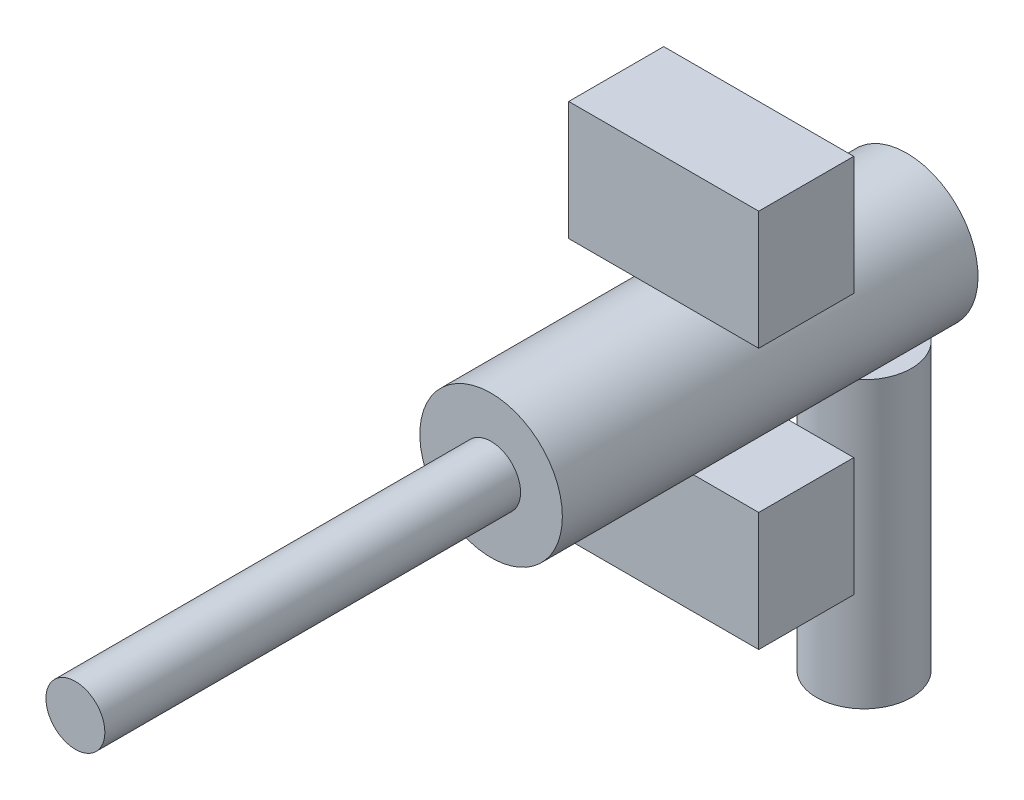
ISO-10303-21;
HEADER;
FILE_DESCRIPTION(('STEP AP214'),'2;1');
FILE_NAME('part.step','',(''),(''),'','','');
FILE_SCHEMA(('AUTOMOTIVE_DESIGN { 1 0 10303 214 1 1 1 1 }'));
ENDSEC;
DATA;
#1=APPLICATION_CONTEXT('core data for automotive mechanical design processes');
#2=APPLICATION_PROTOCOL_DEFINITION('international standard','automotive_design',2000,#1);
#3=PRODUCT_CONTEXT('',#1,'mechanical');
#4=PRODUCT('Part','Part','',(#3));
#5=PRODUCT_RELATED_PRODUCT_CATEGORY('part','',(#4));
#6=PRODUCT_DEFINITION_FORMATION('','',#4);
#7=PRODUCT_DEFINITION_CONTEXT('part definition',#1,'design');
#8=PRODUCT_DEFINITION('design','',#6,#7);
#9=PRODUCT_DEFINITION_SHAPE('','',#8);
#10=(LENGTH_UNIT() NAMED_UNIT(*) SI_UNIT(.MILLI.,.METRE.));
#11=(NAMED_UNIT(*) PLANE_ANGLE_UNIT() SI_UNIT($,.RADIAN.));
#12=(NAMED_UNIT(*) SI_UNIT($,.STERADIAN.) SOLID_ANGLE_UNIT());
#13=UNCERTAINTY_MEASURE_WITH_UNIT(LENGTH_MEASURE(1.E-05),#10,'distance_accuracy_value','');
#14=(GEOMETRIC_REPRESENTATION_CONTEXT(3) GLOBAL_UNCERTAINTY_ASSIGNED_CONTEXT((#13)) GLOBAL_UNIT_ASSIGNED_CONTEXT((#10,
#11,#12)) REPRESENTATION_CONTEXT('',''));
#15=CARTESIAN_POINT('',(0.,0.,0.));
#16=DIRECTION('',(0.,0.,1.));
#17=DIRECTION('',(1.,0.,0.));
#18=AXIS2_PLACEMENT_3D('',#15,#16,#17);
#19=CARTESIAN_POINT('',(-40.,179.48753108507,102.321831747482));
#20=DIRECTION('',(0.,0.,1.));
#21=DIRECTION('',(1.,0.,0.));
#22=AXIS2_PLACEMENT_3D('',#19,#20,#21);
#23=PLANE('',#22);
#24=DIRECTION('',(1.,0.,0.));
#25=VECTOR('',#24,1.);
#26=CARTESIAN_POINT('',(-40.,179.48753108507,102.321831747482));
#27=LINE('',#26,#25);
#28=CARTESIAN_POINT('',(-40.,179.48753108507,102.321831747482));
#29=VERTEX_POINT('',#28);
#30=CARTESIAN_POINT('',(40.,179.48753108507,102.321831747482));
#31=VERTEX_POINT('',#30);
#32=EDGE_CURVE('E55',#29,#31,#27,.T.);
#33=ORIENTED_EDGE('',*,*,#32,.T.);
#34=DIRECTION('',(0.,-1.,0.));
#35=VECTOR('',#34,1.);
#36=CARTESIAN_POINT('',(40.,179.48753108507,102.321831747482));
#37=LINE('',#36,#35);
#38=CARTESIAN_POINT('',(40.,229.48753108507,102.321831747482));
#39=VERTEX_POINT('',#38);
#40=EDGE_CURVE('E92',#39,#31,#37,.T.);
#41=ORIENTED_EDGE('',*,*,#40,.F.);
#42=DIRECTION('',(1.,0.,0.));
#43=VECTOR('',#42,1.);
#44=CARTESIAN_POINT('',(-40.,229.48753108507,102.321831747482));
#45=LINE('',#44,#43);
#46=CARTESIAN_POINT('',(-40.,229.48753108507,102.321831747482));
#47=VERTEX_POINT('',#46);
#48=EDGE_CURVE('E12',#47,#39,#45,.T.);
#49=ORIENTED_EDGE('',*,*,#48,.F.);
#50=DIRECTION('',(0.,-1.,0.));
#51=VECTOR('',#50,1.);
#52=CARTESIAN_POINT('',(-40.,179.48753108507,102.321831747482));
#53=LINE('',#52,#51);
#54=EDGE_CURVE('E93',#47,#29,#53,.T.);
#55=ORIENTED_EDGE('',*,*,#54,.T.);
#56=EDGE_LOOP('',(#33,#41,#49,#55));
#57=FACE_BOUND('',#56,.T.);
#58=ADVANCED_FACE('F52',(#57),#23,.T.);
#59=CARTESIAN_POINT('',(-40.,229.48753108507,102.321831747482));
#60=DIRECTION('',(0.,1.,0.));
#61=DIRECTION('',(0.,0.,1.));
#62=AXIS2_PLACEMENT_3D('',#59,#60,#61);
#63=PLANE('',#62);
#64=ORIENTED_EDGE('',*,*,#48,.T.);
#65=DIRECTION('',(0.,0.,1.));
#66=VECTOR('',#65,1.);
#67=CARTESIAN_POINT('',(40.,229.48753108507,102.321831747482));
#68=LINE('',#67,#66);
#69=CARTESIAN_POINT('',(40.,229.48753108507,62.3218317474823));
#70=VERTEX_POINT('',#69);
#71=EDGE_CURVE('E109',#70,#39,#68,.T.);
#72=ORIENTED_EDGE('',*,*,#71,.F.);
#73=DIRECTION('',(1.,0.,0.));
#74=VECTOR('',#73,1.);
#75=CARTESIAN_POINT('',(-40.,229.48753108507,62.3218317474823));
#76=LINE('',#75,#74);
#77=CARTESIAN_POINT('',(-40.,229.48753108507,62.3218317474823));
#78=VERTEX_POINT('',#77);
#79=EDGE_CURVE('E60',#78,#70,#76,.T.);
#80=ORIENTED_EDGE('',*,*,#79,.F.);
#81=DIRECTION('',(0.,0.,1.));
#82=VECTOR('',#81,1.);
#83=CARTESIAN_POINT('',(-40.,229.48753108507,102.321831747482));
#84=LINE('',#83,#82);
#85=EDGE_CURVE('E98',#78,#47,#84,.T.);
#86=ORIENTED_EDGE('',*,*,#85,.T.);
#87=EDGE_LOOP('',(#64,#72,#80,#86));
#88=FACE_BOUND('',#87,.T.);
#89=ADVANCED_FACE('F124',(#88),#63,.T.);
#90=CARTESIAN_POINT('',(-40.,179.48753108507,62.3218317474823));
#91=DIRECTION('',(0.,0.,-1.));
#92=DIRECTION('',(-1.,0.,0.));
#93=AXIS2_PLACEMENT_3D('',#90,#91,#92);
#94=PLANE('',#93);
#95=ORIENTED_EDGE('',*,*,#79,.T.);
#96=DIRECTION('',(0.,1.,0.));
#97=VECTOR('',#96,1.);
#98=CARTESIAN_POINT('',(40.,179.48753108507,62.3218317474823));
#99=LINE('',#98,#97);
#100=CARTESIAN_POINT('',(40.,179.48753108507,62.3218317474823));
#101=VERTEX_POINT('',#100);
#102=EDGE_CURVE('E105',#101,#70,#99,.T.);
#103=ORIENTED_EDGE('',*,*,#102,.F.);
#104=DIRECTION('',(1.,0.,0.));
#105=VECTOR('',#104,1.);
#106=CARTESIAN_POINT('',(-40.,179.48753108507,62.3218317474823));
#107=LINE('',#106,#105);
#108=CARTESIAN_POINT('',(-40.,179.48753108507,62.3218317474823));
#109=VERTEX_POINT('',#108);
#110=EDGE_CURVE('E97',#109,#101,#107,.T.);
#111=ORIENTED_EDGE('',*,*,#110,.F.);
#112=DIRECTION('',(0.,1.,0.));
#113=VECTOR('',#112,1.);
#114=CARTESIAN_POINT('',(-40.,179.48753108507,62.3218317474823));
#115=LINE('',#114,#113);
#116=EDGE_CURVE('E117',#109,#78,#115,.T.);
#117=ORIENTED_EDGE('',*,*,#116,.T.);
#118=EDGE_LOOP('',(#95,#103,#111,#117));
#119=FACE_BOUND('',#118,.T.);
#120=ADVANCED_FACE('F121',(#119),#94,.T.);
#121=CARTESIAN_POINT('',(-40.,179.48753108507,102.321831747482));
#122=DIRECTION('',(0.,-1.,0.));
#123=DIRECTION('',(0.,0.,-1.));
#124=AXIS2_PLACEMENT_3D('',#121,#122,#123);
#125=PLANE('',#124);
#126=ORIENTED_EDGE('',*,*,#110,.T.);
#127=DIRECTION('',(0.,0.,-1.));
#128=VECTOR('',#127,1.);
#129=CARTESIAN_POINT('',(40.,179.48753108507,102.321831747482));
#130=LINE('',#129,#128);
#131=EDGE_CURVE('E100',#31,#101,#130,.T.);
#132=ORIENTED_EDGE('',*,*,#131,.F.);
#133=ORIENTED_EDGE('',*,*,#32,.F.);
#134=DIRECTION('',(0.,0.,-1.));
#135=VECTOR('',#134,1.);
#136=CARTESIAN_POINT('',(-40.,179.48753108507,102.321831747482));
#137=LINE('',#136,#135);
#138=EDGE_CURVE('E115',#29,#109,#137,.T.);
#139=ORIENTED_EDGE('',*,*,#138,.T.);
#140=EDGE_LOOP('',(#126,#132,#133,#139));
#141=FACE_BOUND('',#140,.T.);
#142=ADVANCED_FACE('F101',(#141),#125,.T.);
#143=CARTESIAN_POINT('',(-40.,0.,0.));
#144=DIRECTION('',(-1.,0.,0.));
#145=DIRECTION('',(0.,0.,1.));
#146=AXIS2_PLACEMENT_3D('',#143,#144,#145);
#147=PLANE('',#146);
#148=ORIENTED_EDGE('',*,*,#54,.F.);
#149=ORIENTED_EDGE('',*,*,#85,.F.);
#150=ORIENTED_EDGE('',*,*,#116,.F.);
#151=ORIENTED_EDGE('',*,*,#138,.F.);
#152=EDGE_LOOP('',(#148,#149,#150,#151));
#153=FACE_BOUND('',#152,.T.);
#154=ADVANCED_FACE('F126',(#153),#147,.T.);
#155=CARTESIAN_POINT('',(40.,0.,0.));
#156=DIRECTION('',(-1.,0.,0.));
#157=DIRECTION('',(0.,0.,1.));
#158=AXIS2_PLACEMENT_3D('',#155,#156,#157);
#159=PLANE('',#158);
#160=ORIENTED_EDGE('',*,*,#40,.T.);
#161=ORIENTED_EDGE('',*,*,#131,.T.);
#162=ORIENTED_EDGE('',*,*,#102,.T.);
#163=ORIENTED_EDGE('',*,*,#71,.T.);
#164=EDGE_LOOP('',(#160,#161,#162,#163));
#165=FACE_BOUND('',#164,.T.);
#166=ADVANCED_FACE('F108',(#165),#159,.F.);
#167=CLOSED_SHELL('',(#58,#89,#120,#142,#154,#166));
#168=MANIFOLD_SOLID_BREP('B2',#167);
#169=CARTESIAN_POINT('',(0.,120.,17.9882332348629));
#170=DIRECTION('',(0.,-1.,0.));
#171=DIRECTION('',(0.,0.,-1.));
#172=AXIS2_PLACEMENT_3D('',#169,#170,#171);
#173=CYLINDRICAL_SURFACE('',#172,20.);
#174=CARTESIAN_POINT('',(0.,0.,17.9882332348629));
#175=DIRECTION('',(0.,1.,0.));
#176=DIRECTION('',(0.,0.,1.));
#177=AXIS2_PLACEMENT_3D('',#174,#175,#176);
#178=CIRCLE('',#177,20.);
#179=CARTESIAN_POINT('',(0.,0.,37.9882332348629));
#180=VERTEX_POINT('',#179);
#181=EDGE_CURVE('E301',#180,#180,#178,.T.);
#182=ORIENTED_EDGE('',*,*,#181,.T.);
#183=EDGE_LOOP('',(#182));
#184=FACE_BOUND('',#183,.T.);
#185=CARTESIAN_POINT('',(-5.52136853570222,120.,37.2109929090865));
#186=CARTESIAN_POINT('',(-5.29193302138808,119.957037804867,37.2768943103946));
#187=CARTESIAN_POINT('',(-5.06091253679001,119.916554845313,37.3388024333484));
#188=CARTESIAN_POINT('',(-4.59598902122757,119.840737590571,37.45446777266));
#189=CARTESIAN_POINT('',(-4.36208580677418,119.805403624977,37.5082244672428));
#190=CARTESIAN_POINT('',(-3.65650935186533,119.707415802089,37.657012798175));
#191=CARTESIAN_POINT('',(-3.18098714133821,119.652779380687,37.7395575443784));
#192=CARTESIAN_POINT('',(-2.23648701823118,119.567357095238,37.8683503241664));
#193=CARTESIAN_POINT('',(-1.76769162302292,119.535953618657,37.9155387256518));
#194=CARTESIAN_POINT('',(-0.827057573782967,119.495240836377,37.9766799810276));
#195=CARTESIAN_POINT('',(-0.355219623911195,119.485926590303,37.9906402665685));
#196=CARTESIAN_POINT('',(0.569300120255673,119.489514564927,37.9852577339645));
#197=CARTESIAN_POINT('',(1.02199373849564,119.501543628949,37.9672238052882));
#198=CARTESIAN_POINT('',(1.92417509509118,119.545894783714,37.9005962290482));
#199=CARTESIAN_POINT('',(2.37366234055385,119.578219929223,37.8519979812443));
#200=CARTESIAN_POINT('',(3.27874165463821,119.663681644793,37.7230855988506));
#201=CARTESIAN_POINT('',(3.73416545758765,119.717362201779,37.641941952275));
#202=CARTESIAN_POINT('',(4.41014591507068,119.812584102018,37.4973022562262));
#203=CARTESIAN_POINT('',(4.63428007047814,119.8467748898,37.44526835514));
#204=CARTESIAN_POINT('',(5.07988498020442,119.919884182736,37.3337108859222));
#205=CARTESIAN_POINT('',(5.3013558830419,119.958802422903,37.2741877375769));
#206=CARTESIAN_POINT('',(5.52136853570222,120.,37.2109929090865));
#207=B_SPLINE_CURVE_WITH_KNOTS('',3,(#185,#186,#187,#188,#189,#190,#191,#192,#193,#194,#195,
#196,#197,#198,#199,#200,#201,#202,#203,#204,#205,#206),.UNSPECIFIED.,.F.,.F.,(4,2,2,2,2,2,2,2,
2,2,4),(0.,0.727539342602564,1.45512523556241,2.91035344813136,4.32535051133285,
5.74003107292185,7.09816389103255,8.45650117085002,9.85191582673059,10.5496223790287,
11.2472898409633),.UNSPECIFIED.);
#208=CARTESIAN_POINT('',(-5.52136853570222,120.,37.2109929090865));
#209=VERTEX_POINT('',#208);
#210=CARTESIAN_POINT('',(5.52136853570222,120.,37.2109929090865));
#211=VERTEX_POINT('',#210);
#212=EDGE_CURVE('E293',#209,#211,#207,.T.);
#213=ORIENTED_EDGE('',*,*,#212,.F.);
#214=CARTESIAN_POINT('',(0.,120.,17.9882332348629));
#215=DIRECTION('',(0.,1.,0.));
#216=DIRECTION('',(0.,0.,1.));
#217=AXIS2_PLACEMENT_3D('',#214,#215,#216);
#218=CIRCLE('',#217,20.);
#219=EDGE_CURVE('E302',#211,#209,#218,.T.);
#220=ORIENTED_EDGE('',*,*,#219,.F.);
#221=EDGE_LOOP('',(#213,#220));
#222=FACE_BOUND('',#221,.T.);
#223=ADVANCED_FACE('F175',(#184,#222),#173,.T.);
#224=CARTESIAN_POINT('',(0.,120.,17.9882332348629));
#225=DIRECTION('',(0.,1.,0.));
#226=DIRECTION('',(0.,0.,1.));
#227=AXIS2_PLACEMENT_3D('',#224,#225,#226);
#228=PLANE('',#227);
#229=DIRECTION('',(1.,0.,0.));
#230=VECTOR('',#229,1.);
#231=CARTESIAN_POINT('',(0.,120.,0.));
#232=LINE('',#231,#230);
#233=CARTESIAN_POINT('',(-5.52136853570222,120.,0.));
#234=VERTEX_POINT('',#233);
#235=CARTESIAN_POINT('',(5.52136853570222,120.,0.));
#236=VERTEX_POINT('',#235);
#237=EDGE_CURVE('E336',#234,#236,#232,.T.);
#238=ORIENTED_EDGE('',*,*,#237,.T.);
#239=DIRECTION('',(0.,0.,-1.));
#240=VECTOR('',#239,1.);
#241=CARTESIAN_POINT('',(5.52136853570222,120.,175.));
#242=LINE('',#241,#240);
#243=EDGE_CURVE('E289',#236,#211,#242,.F.);
#244=ORIENTED_EDGE('',*,*,#243,.T.);
#245=ORIENTED_EDGE('',*,*,#219,.T.);
#246=DIRECTION('',(0.,0.,-1.));
#247=VECTOR('',#246,1.);
#248=CARTESIAN_POINT('',(-5.52136853570222,120.,175.));
#249=LINE('',#248,#247);
#250=EDGE_CURVE('E335',#209,#234,#249,.T.);
#251=ORIENTED_EDGE('',*,*,#250,.T.);
#252=EDGE_LOOP('',(#238,#244,#245,#251));
#253=FACE_BOUND('',#252,.T.);
#254=ADVANCED_FACE('F314',(#253),#228,.T.);
#255=CARTESIAN_POINT('',(0.,0.,17.9882332348629));
#256=DIRECTION('',(0.,1.,0.));
#257=DIRECTION('',(0.,0.,1.));
#258=AXIS2_PLACEMENT_3D('',#255,#256,#257);
#259=PLANE('',#258);
#260=ORIENTED_EDGE('',*,*,#181,.F.);
#261=EDGE_LOOP('',(#260));
#262=FACE_BOUND('',#261,.T.);
#263=ADVANCED_FACE('F310',(#262),#259,.F.);
#264=CARTESIAN_POINT('',(0.,149.48753108507,175.));
#265=DIRECTION('',(0.,0.,-1.));
#266=DIRECTION('',(-1.,0.,0.));
#267=AXIS2_PLACEMENT_3D('',#264,#265,#266);
#268=CYLINDRICAL_SURFACE('',#267,30.);
#269=DIRECTION('',(0.,0.,-1.));
#270=VECTOR('',#269,1.);
#271=CARTESIAN_POINT('',(-3.03737003392138,119.641687433448,175.));
#272=LINE('',#271,#270);
#273=CARTESIAN_POINT('',(-3.03737003392138,119.641687433448,62.3218317474823));
#274=VERTEX_POINT('',#273);
#275=CARTESIAN_POINT('',(-3.03737003392138,119.641687433448,102.321831747482));
#276=VERTEX_POINT('',#275);
#277=EDGE_CURVE('E343',#274,#276,#272,.F.);
#278=ORIENTED_EDGE('',*,*,#277,.T.);
#279=CARTESIAN_POINT('',(0.,149.48753108507,102.321831747482));
#280=DIRECTION('',(0.,0.,1.));
#281=DIRECTION('',(1.,0.,0.));
#282=AXIS2_PLACEMENT_3D('',#279,#280,#281);
#283=CIRCLE('',#282,30.);
#284=CARTESIAN_POINT('',(3.03737003392138,119.641687433448,102.321831747482));
#285=VERTEX_POINT('',#284);
#286=EDGE_CURVE('E50',#276,#285,#283,.T.);
#287=ORIENTED_EDGE('',*,*,#286,.T.);
#288=DIRECTION('',(0.,0.,-1.));
#289=VECTOR('',#288,1.);
#290=CARTESIAN_POINT('',(3.03737003392138,119.641687433448,175.));
#291=LINE('',#290,#289);
#292=CARTESIAN_POINT('',(3.03737003392138,119.641687433448,62.3218317474823));
#293=VERTEX_POINT('',#292);
#294=EDGE_CURVE('E183',#285,#293,#291,.T.);
#295=ORIENTED_EDGE('',*,*,#294,.T.);
#296=CARTESIAN_POINT('',(0.,149.48753108507,62.3218317474823));
#297=DIRECTION('',(0.,0.,-1.));
#298=DIRECTION('',(-1.,0.,0.));
#299=AXIS2_PLACEMENT_3D('',#296,#297,#298);
#300=CIRCLE('',#299,30.);
#301=EDGE_CURVE('E288',#293,#274,#300,.T.);
#302=ORIENTED_EDGE('',*,*,#301,.T.);
#303=EDGE_LOOP('',(#278,#287,#295,#302));
#304=FACE_BOUND('',#303,.T.);
#305=ORIENTED_EDGE('',*,*,#243,.F.);
#306=CARTESIAN_POINT('',(0.,149.48753108507,0.));
#307=DIRECTION('',(0.,0.,1.));
#308=DIRECTION('',(1.,0.,0.));
#309=AXIS2_PLACEMENT_3D('',#306,#307,#308);
#310=CIRCLE('',#309,30.);
#311=EDGE_CURVE('E197',#236,#234,#310,.T.);
#312=ORIENTED_EDGE('',*,*,#311,.T.);
#313=ORIENTED_EDGE('',*,*,#250,.F.);
#314=ORIENTED_EDGE('',*,*,#212,.T.);
#315=EDGE_LOOP('',(#305,#312,#313,#314));
#316=FACE_BOUND('',#315,.T.);
#317=CARTESIAN_POINT('',(0.,149.48753108507,175.));
#318=DIRECTION('',(0.,0.,1.));
#319=DIRECTION('',(1.,0.,0.));
#320=AXIS2_PLACEMENT_3D('',#317,#318,#319);
#321=CIRCLE('',#320,30.);
#322=CARTESIAN_POINT('',(30.,149.48753108507,175.));
#323=VERTEX_POINT('',#322);
#324=EDGE_CURVE('E290',#323,#323,#321,.T.);
#325=ORIENTED_EDGE('',*,*,#324,.F.);
#326=EDGE_LOOP('',(#325));
#327=FACE_BOUND('',#326,.T.);
#328=ADVANCED_FACE('F304',(#304,#316,#327),#268,.T.);
#329=CARTESIAN_POINT('',(0.,149.48753108507,175.));
#330=DIRECTION('',(0.,0.,1.));
#331=DIRECTION('',(1.,0.,0.));
#332=AXIS2_PLACEMENT_3D('',#329,#330,#331);
#333=PLANE('',#332);
#334=CARTESIAN_POINT('',(0.,149.48753108507,175.));
#335=DIRECTION('',(0.,0.,1.));
#336=DIRECTION('',(1.,0.,0.));
#337=AXIS2_PLACEMENT_3D('',#334,#335,#336);
#338=CIRCLE('',#337,12.4009204125942);
#339=CARTESIAN_POINT('',(12.4009204125942,149.48753108507,175.));
#340=VERTEX_POINT('',#339);
#341=EDGE_CURVE('E285',#340,#340,#338,.T.);
#342=ORIENTED_EDGE('',*,*,#341,.F.);
#343=EDGE_LOOP('',(#342));
#344=FACE_BOUND('',#343,.T.);
#345=ORIENTED_EDGE('',*,*,#324,.T.);
#346=EDGE_LOOP('',(#345));
#347=FACE_BOUND('',#346,.T.);
#348=ADVANCED_FACE('F309',(#344,#347),#333,.T.);
#349=CARTESIAN_POINT('',(0.,149.48753108507,0.));
#350=DIRECTION('',(0.,0.,1.));
#351=DIRECTION('',(1.,0.,0.));
#352=AXIS2_PLACEMENT_3D('',#349,#350,#351);
#353=PLANE('',#352);
#354=ORIENTED_EDGE('',*,*,#237,.F.);
#355=ORIENTED_EDGE('',*,*,#311,.F.);
#356=EDGE_LOOP('',(#354,#355));
#357=FACE_BOUND('',#356,.T.);
#358=ADVANCED_FACE('F312',(#357),#353,.F.);
#359=CARTESIAN_POINT('',(0.,149.48753108507,350.));
#360=DIRECTION('',(0.,0.,-1.));
#361=DIRECTION('',(-1.,0.,0.));
#362=AXIS2_PLACEMENT_3D('',#359,#360,#361);
#363=CYLINDRICAL_SURFACE('',#362,12.4009204125942);
#364=CARTESIAN_POINT('',(0.,149.48753108507,350.));
#365=DIRECTION('',(0.,0.,1.));
#366=DIRECTION('',(1.,0.,0.));
#367=AXIS2_PLACEMENT_3D('',#364,#365,#366);
#368=CIRCLE('',#367,12.4009204125942);
#369=CARTESIAN_POINT('',(12.4009204125942,149.48753108507,350.));
#370=VERTEX_POINT('',#369);
#371=EDGE_CURVE('E282',#370,#370,#368,.T.);
#372=ORIENTED_EDGE('',*,*,#371,.F.);
#373=EDGE_LOOP('',(#372));
#374=FACE_BOUND('',#373,.T.);
#375=ORIENTED_EDGE('',*,*,#341,.T.);
#376=EDGE_LOOP('',(#375));
#377=FACE_BOUND('',#376,.T.);
#378=ADVANCED_FACE('F375',(#374,#377),#363,.T.);
#379=CARTESIAN_POINT('',(0.,149.48753108507,350.));
#380=DIRECTION('',(0.,0.,1.));
#381=DIRECTION('',(1.,0.,0.));
#382=AXIS2_PLACEMENT_3D('',#379,#380,#381);
#383=PLANE('',#382);
#384=ORIENTED_EDGE('',*,*,#371,.T.);
#385=EDGE_LOOP('',(#384));
#386=FACE_BOUND('',#385,.T.);
#387=ADVANCED_FACE('F369',(#386),#383,.T.);
#388=CARTESIAN_POINT('',(-40.,119.641687433448,102.321831747482));
#389=DIRECTION('',(0.,1.,0.));
#390=DIRECTION('',(0.,0.,1.));
#391=AXIS2_PLACEMENT_3D('',#388,#389,#390);
#392=PLANE('',#391);
#393=ORIENTED_EDGE('',*,*,#294,.F.);
#394=DIRECTION('',(1.,0.,0.));
#395=VECTOR('',#394,1.);
#396=CARTESIAN_POINT('',(-40.,119.641687433448,102.321831747482));
#397=LINE('',#396,#395);
#398=CARTESIAN_POINT('',(40.,119.641687433448,102.321831747482));
#399=VERTEX_POINT('',#398);
#400=EDGE_CURVE('E249',#285,#399,#397,.T.);
#401=ORIENTED_EDGE('',*,*,#400,.T.);
#402=DIRECTION('',(0.,0.,1.));
#403=VECTOR('',#402,1.);
#404=CARTESIAN_POINT('',(40.,119.641687433448,102.321831747482));
#405=LINE('',#404,#403);
#406=CARTESIAN_POINT('',(40.,119.641687433448,62.3218317474823));
#407=VERTEX_POINT('',#406);
#408=EDGE_CURVE('E259',#407,#399,#405,.T.);
#409=ORIENTED_EDGE('',*,*,#408,.F.);
#410=DIRECTION('',(1.,0.,0.));
#411=VECTOR('',#410,1.);
#412=CARTESIAN_POINT('',(-40.,119.641687433448,62.3218317474823));
#413=LINE('',#412,#411);
#414=EDGE_CURVE('E248',#293,#407,#413,.T.);
#415=ORIENTED_EDGE('',*,*,#414,.F.);
#416=EDGE_LOOP('',(#393,#401,#409,#415));
#417=FACE_BOUND('',#416,.T.);
#418=ADVANCED_FACE('F347',(#417),#392,.T.);
#419=ORIENTED_EDGE('',*,*,#277,.F.);
#420=CARTESIAN_POINT('',(-40.,119.641687433448,62.3218317474823));
#421=VERTEX_POINT('',#420);
#422=EDGE_CURVE('E190',#421,#274,#413,.T.);
#423=ORIENTED_EDGE('',*,*,#422,.F.);
#424=DIRECTION('',(0.,0.,1.));
#425=VECTOR('',#424,1.);
#426=CARTESIAN_POINT('',(-40.,119.641687433448,102.321831747482));
#427=LINE('',#426,#425);
#428=CARTESIAN_POINT('',(-40.,119.641687433448,102.321831747482));
#429=VERTEX_POINT('',#428);
#430=EDGE_CURVE('E256',#421,#429,#427,.T.);
#431=ORIENTED_EDGE('',*,*,#430,.T.);
#432=EDGE_CURVE('E240',#429,#276,#397,.T.);
#433=ORIENTED_EDGE('',*,*,#432,.T.);
#434=EDGE_LOOP('',(#419,#423,#431,#433));
#435=FACE_BOUND('',#434,.T.);
#436=ADVANCED_FACE('F261',(#435),#392,.T.);
#437=CARTESIAN_POINT('',(-40.,119.641687433448,102.321831747482));
#438=DIRECTION('',(0.,0.,1.));
#439=DIRECTION('',(1.,0.,0.));
#440=AXIS2_PLACEMENT_3D('',#437,#438,#439);
#441=PLANE('',#440);
#442=ORIENTED_EDGE('',*,*,#286,.F.);
#443=ORIENTED_EDGE('',*,*,#432,.F.);
#444=DIRECTION('',(0.,-1.,0.));
#445=VECTOR('',#444,1.);
#446=CARTESIAN_POINT('',(-40.,119.641687433448,102.321831747482));
#447=LINE('',#446,#445);
#448=CARTESIAN_POINT('',(-40.,69.6416874334483,102.321831747482));
#449=VERTEX_POINT('',#448);
#450=EDGE_CURVE('E243',#429,#449,#447,.T.);
#451=ORIENTED_EDGE('',*,*,#450,.T.);
#452=DIRECTION('',(1.,0.,0.));
#453=VECTOR('',#452,1.);
#454=CARTESIAN_POINT('',(-40.,69.6416874334483,102.321831747482));
#455=LINE('',#454,#453);
#456=CARTESIAN_POINT('',(40.,69.6416874334483,102.321831747482));
#457=VERTEX_POINT('',#456);
#458=EDGE_CURVE('E263',#449,#457,#455,.T.);
#459=ORIENTED_EDGE('',*,*,#458,.T.);
#460=DIRECTION('',(0.,-1.,0.));
#461=VECTOR('',#460,1.);
#462=CARTESIAN_POINT('',(40.,119.641687433448,102.321831747482));
#463=LINE('',#462,#461);
#464=EDGE_CURVE('E279',#399,#457,#463,.T.);
#465=ORIENTED_EDGE('',*,*,#464,.F.);
#466=ORIENTED_EDGE('',*,*,#400,.F.);
#467=EDGE_LOOP('',(#442,#443,#451,#459,#465,#466));
#468=FACE_BOUND('',#467,.T.);
#469=ADVANCED_FACE('F242',(#468),#441,.T.);
#470=CARTESIAN_POINT('',(-40.,119.641687433448,62.3218317474823));
#471=DIRECTION('',(0.,0.,-1.));
#472=DIRECTION('',(-1.,0.,0.));
#473=AXIS2_PLACEMENT_3D('',#470,#471,#472);
#474=PLANE('',#473);
#475=ORIENTED_EDGE('',*,*,#301,.F.);
#476=ORIENTED_EDGE('',*,*,#414,.T.);
#477=DIRECTION('',(0.,1.,0.));
#478=VECTOR('',#477,1.);
#479=CARTESIAN_POINT('',(40.,119.641687433448,62.3218317474823));
#480=LINE('',#479,#478);
#481=CARTESIAN_POINT('',(40.,69.6416874334483,62.3218317474823));
#482=VERTEX_POINT('',#481);
#483=EDGE_CURVE('E273',#482,#407,#480,.T.);
#484=ORIENTED_EDGE('',*,*,#483,.F.);
#485=DIRECTION('',(1.,0.,0.));
#486=VECTOR('',#485,1.);
#487=CARTESIAN_POINT('',(-40.,69.6416874334483,62.3218317474823));
#488=LINE('',#487,#486);
#489=CARTESIAN_POINT('',(-40.,69.6416874334483,62.3218317474823));
#490=VERTEX_POINT('',#489);
#491=EDGE_CURVE('E266',#490,#482,#488,.T.);
#492=ORIENTED_EDGE('',*,*,#491,.F.);
#493=DIRECTION('',(0.,1.,0.));
#494=VECTOR('',#493,1.);
#495=CARTESIAN_POINT('',(-40.,119.641687433448,62.3218317474823));
#496=LINE('',#495,#494);
#497=EDGE_CURVE('E262',#490,#421,#496,.T.);
#498=ORIENTED_EDGE('',*,*,#497,.T.);
#499=ORIENTED_EDGE('',*,*,#422,.T.);
#500=EDGE_LOOP('',(#475,#476,#484,#492,#498,#499));
#501=FACE_BOUND('',#500,.T.);
#502=ADVANCED_FACE('F354',(#501),#474,.T.);
#503=CARTESIAN_POINT('',(-40.,69.6416874334483,102.321831747482));
#504=DIRECTION('',(0.,-1.,0.));
#505=DIRECTION('',(0.,0.,-1.));
#506=AXIS2_PLACEMENT_3D('',#503,#504,#505);
#507=PLANE('',#506);
#508=ORIENTED_EDGE('',*,*,#491,.T.);
#509=DIRECTION('',(0.,0.,-1.));
#510=VECTOR('',#509,1.);
#511=CARTESIAN_POINT('',(40.,69.6416874334483,102.321831747482));
#512=LINE('',#511,#510);
#513=EDGE_CURVE('E276',#457,#482,#512,.T.);
#514=ORIENTED_EDGE('',*,*,#513,.F.);
#515=ORIENTED_EDGE('',*,*,#458,.F.);
#516=DIRECTION('',(0.,0.,-1.));
#517=VECTOR('',#516,1.);
#518=CARTESIAN_POINT('',(-40.,69.6416874334483,102.321831747482));
#519=LINE('',#518,#517);
#520=EDGE_CURVE('E258',#449,#490,#519,.T.);
#521=ORIENTED_EDGE('',*,*,#520,.T.);
#522=EDGE_LOOP('',(#508,#514,#515,#521));
#523=FACE_BOUND('',#522,.T.);
#524=ADVANCED_FACE('F357',(#523),#507,.T.);
#525=CARTESIAN_POINT('',(-40.,0.,0.));
#526=DIRECTION('',(1.,0.,0.));
#527=DIRECTION('',(0.,0.,-1.));
#528=AXIS2_PLACEMENT_3D('',#525,#526,#527);
#529=PLANE('',#528);
#530=ORIENTED_EDGE('',*,*,#450,.F.);
#531=ORIENTED_EDGE('',*,*,#430,.F.);
#532=ORIENTED_EDGE('',*,*,#497,.F.);
#533=ORIENTED_EDGE('',*,*,#520,.F.);
#534=EDGE_LOOP('',(#530,#531,#532,#533));
#535=FACE_BOUND('',#534,.T.);
#536=ADVANCED_FACE('F254',(#535),#529,.F.);
#537=CARTESIAN_POINT('',(40.,0.,0.));
#538=DIRECTION('',(1.,0.,0.));
#539=DIRECTION('',(0.,0.,-1.));
#540=AXIS2_PLACEMENT_3D('',#537,#538,#539);
#541=PLANE('',#540);
#542=ORIENTED_EDGE('',*,*,#464,.T.);
#543=ORIENTED_EDGE('',*,*,#513,.T.);
#544=ORIENTED_EDGE('',*,*,#483,.T.);
#545=ORIENTED_EDGE('',*,*,#408,.T.);
#546=EDGE_LOOP('',(#542,#543,#544,#545));
#547=FACE_BOUND('',#546,.T.);
#548=ADVANCED_FACE('F352',(#547),#541,.T.);
#549=CLOSED_SHELL('',(#223,#254,#263,#328,#348,#358,#378,#387,#418,#436,#469,#502,#524,#536,#548));
#550=MANIFOLD_SOLID_BREP('B6',#549);
#551=ADVANCED_BREP_SHAPE_REPRESENTATION('',(#18,#168,#550),#14);
#552=SHAPE_DEFINITION_REPRESENTATION(#9,#551);
ENDSEC;
END-ISO-10303-21;
